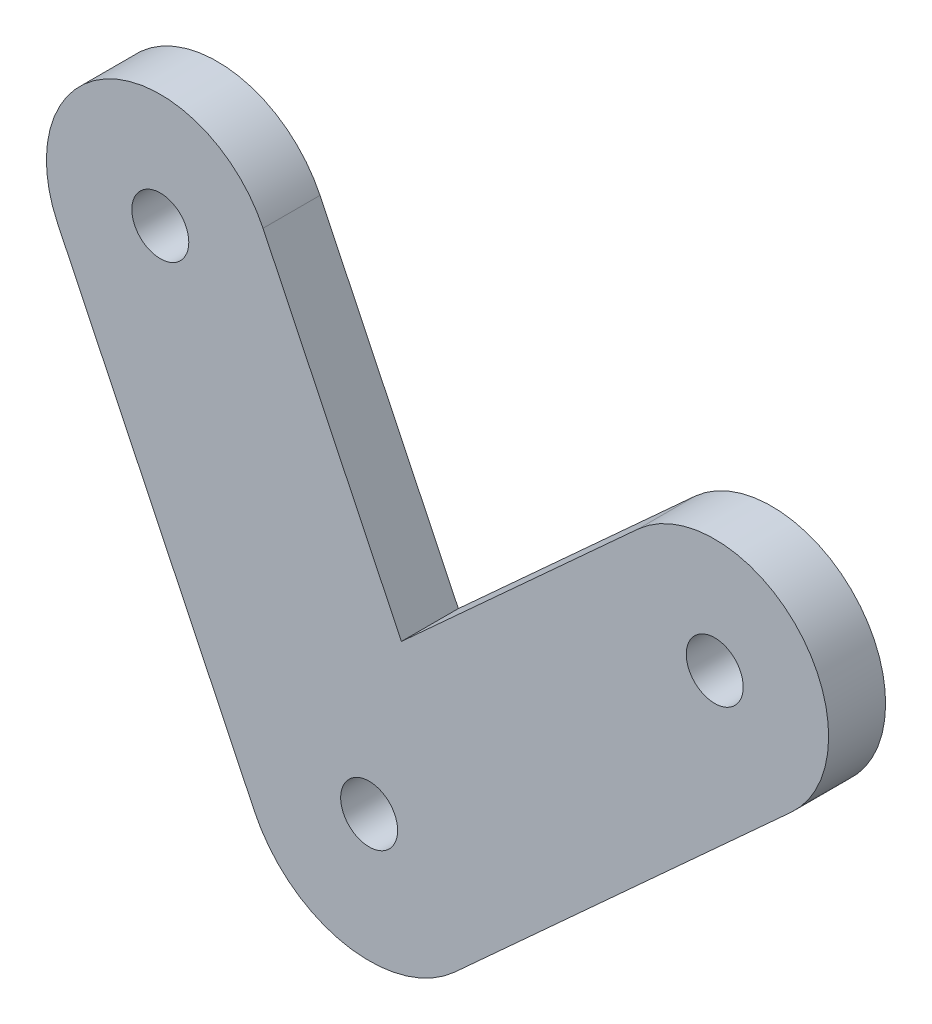
ISO-10303-21;
HEADER;
FILE_DESCRIPTION(('STEP AP214'),'2;1');
FILE_NAME('part.step','',(''),(''),'','','');
FILE_SCHEMA(('AUTOMOTIVE_DESIGN { 1 0 10303 214 1 1 1 1 }'));
ENDSEC;
DATA;
#1=APPLICATION_CONTEXT('core data for automotive mechanical design processes');
#2=APPLICATION_PROTOCOL_DEFINITION('international standard','automotive_design',2000,#1);
#3=PRODUCT_CONTEXT('',#1,'mechanical');
#4=PRODUCT('Part','Part','',(#3));
#5=PRODUCT_RELATED_PRODUCT_CATEGORY('part','',(#4));
#6=PRODUCT_DEFINITION_FORMATION('','',#4);
#7=PRODUCT_DEFINITION_CONTEXT('part definition',#1,'design');
#8=PRODUCT_DEFINITION('design','',#6,#7);
#9=PRODUCT_DEFINITION_SHAPE('','',#8);
#10=(LENGTH_UNIT() NAMED_UNIT(*) SI_UNIT(.MILLI.,.METRE.));
#11=(NAMED_UNIT(*) PLANE_ANGLE_UNIT() SI_UNIT($,.RADIAN.));
#12=(NAMED_UNIT(*) SI_UNIT($,.STERADIAN.) SOLID_ANGLE_UNIT());
#13=UNCERTAINTY_MEASURE_WITH_UNIT(LENGTH_MEASURE(1.E-05),#10,'distance_accuracy_value','');
#14=(GEOMETRIC_REPRESENTATION_CONTEXT(3) GLOBAL_UNCERTAINTY_ASSIGNED_CONTEXT((#13)) GLOBAL_UNIT_ASSIGNED_CONTEXT((#10,
#11,#12)) REPRESENTATION_CONTEXT('',''));
#15=CARTESIAN_POINT('',(0.,0.,0.));
#16=DIRECTION('',(0.,0.,1.));
#17=DIRECTION('',(1.,0.,0.));
#18=AXIS2_PLACEMENT_3D('',#15,#16,#17);
#19=CARTESIAN_POINT('',(24.2357081569548,10.7533268716358,3.175));
#20=DIRECTION('',(0.,0.,1.));
#21=DIRECTION('',(1.,0.,0.));
#22=AXIS2_PLACEMENT_3D('',#19,#20,#21);
#23=PLANE('',#22);
#24=CARTESIAN_POINT('',(24.2357081569548,10.7533268716358,3.175));
#25=DIRECTION('',(0.,0.,1.));
#26=DIRECTION('',(1.,0.,0.));
#27=AXIS2_PLACEMENT_3D('',#24,#25,#26);
#28=CIRCLE('',#27,1.5875);
#29=CARTESIAN_POINT('',(25.8232081569548,10.7533268716358,3.175));
#30=VERTEX_POINT('',#29);
#31=EDGE_CURVE('E164',#30,#30,#28,.T.);
#32=ORIENTED_EDGE('',*,*,#31,.F.);
#33=EDGE_LOOP('',(#32));
#34=FACE_BOUND('',#33,.T.);
#35=CARTESIAN_POINT('',(24.2357081569548,10.7533268716358,3.175));
#36=DIRECTION('',(0.,0.,1.));
#37=DIRECTION('',(1.,0.,0.));
#38=AXIS2_PLACEMENT_3D('',#35,#36,#37);
#39=CIRCLE('',#38,6.35);
#40=CARTESIAN_POINT('',(28.5130909433201,6.060087425485,3.175));
#41=VERTEX_POINT('',#40);
#42=CARTESIAN_POINT('',(19.9583253705896,15.4465663177866,3.175));
#43=VERTEX_POINT('',#42);
#44=EDGE_CURVE('E137',#41,#43,#39,.T.);
#45=ORIENTED_EDGE('',*,*,#44,.T.);
#46=DIRECTION('',(-0.739092826165481,-0.673603588403982,0.));
#47=VECTOR('',#46,1.);
#48=CARTESIAN_POINT('',(6.77121745735409,3.42793632091378,3.175));
#49=LINE('',#48,#47);
#50=CARTESIAN_POINT('',(6.77121745735409,3.42793632091378,3.175));
#51=VERTEX_POINT('',#50);
#52=EDGE_CURVE('E90',#43,#51,#49,.T.);
#53=ORIENTED_EDGE('',*,*,#52,.T.);
#54=DIRECTION('',(-0.432277682531421,0.901740542054788,0.));
#55=VECTOR('',#54,1.);
#56=CARTESIAN_POINT('',(-0.941605947522081,19.5170518106554,3.175));
#57=LINE('',#56,#55);
#58=CARTESIAN_POINT('',(-0.941605947522079,19.5170518106554,3.175));
#59=VERTEX_POINT('',#58);
#60=EDGE_CURVE('E149',#51,#59,#57,.T.);
#61=ORIENTED_EDGE('',*,*,#60,.T.);
#62=CARTESIAN_POINT('',(-6.66765838956999,16.7720885265809,3.175));
#63=DIRECTION('',(0.,0.,1.));
#64=DIRECTION('',(1.,0.,0.));
#65=AXIS2_PLACEMENT_3D('',#62,#63,#64);
#66=CIRCLE('',#65,6.35);
#67=CARTESIAN_POINT('',(-12.3937108316179,14.0271252425063,3.175));
#68=VERTEX_POINT('',#67);
#69=EDGE_CURVE('E106',#59,#68,#66,.T.);
#70=ORIENTED_EDGE('',*,*,#69,.T.);
#71=DIRECTION('',(0.432277682531421,-0.901740542054789,0.));
#72=VECTOR('',#71,1.);
#73=CARTESIAN_POINT('',(-1.41849745212743,-8.86740589320487,3.175));
#74=LINE('',#73,#72);
#75=CARTESIAN_POINT('',(-1.41849745212743,-8.86740589320487,3.175));
#76=VERTEX_POINT('',#75);
#77=EDGE_CURVE('E100',#68,#76,#74,.T.);
#78=ORIENTED_EDGE('',*,*,#77,.T.);
#79=CARTESIAN_POINT('',(4.97333962572611,-5.80327780949156,3.175));
#80=DIRECTION('',(0.,0.,1.));
#81=DIRECTION('',(1.,0.,0.));
#82=AXIS2_PLACEMENT_3D('',#79,#80,#81);
#83=CIRCLE('',#82,7.08833281831658);
#84=CARTESIAN_POINT('',(9.74806604794587,-11.0422137449827,3.175));
#85=VERTEX_POINT('',#84);
#86=EDGE_CURVE('E104',#76,#85,#83,.T.);
#87=ORIENTED_EDGE('',*,*,#86,.T.);
#88=DIRECTION('',(0.739092826165481,0.673603588403983,0.));
#89=VECTOR('',#88,1.);
#90=CARTESIAN_POINT('',(28.5130909433201,6.060087425485,3.175));
#91=LINE('',#90,#89);
#92=EDGE_CURVE('E50',#85,#41,#91,.T.);
#93=ORIENTED_EDGE('',*,*,#92,.T.);
#94=EDGE_LOOP('',(#45,#53,#61,#70,#78,#87,#93));
#95=FACE_BOUND('',#94,.T.);
#96=CARTESIAN_POINT('',(-6.66765838956999,16.7720885265809,3.175));
#97=DIRECTION('',(0.,0.,1.));
#98=DIRECTION('',(1.,0.,0.));
#99=AXIS2_PLACEMENT_3D('',#96,#97,#98);
#100=CIRCLE('',#99,1.5875);
#101=CARTESIAN_POINT('',(-5.08015838956999,16.7720885265809,3.175));
#102=VERTEX_POINT('',#101);
#103=EDGE_CURVE('E128',#102,#102,#100,.T.);
#104=ORIENTED_EDGE('',*,*,#103,.F.);
#105=EDGE_LOOP('',(#104));
#106=FACE_BOUND('',#105,.T.);
#107=CARTESIAN_POINT('',(4.97333962572611,-5.80327780949156,3.175));
#108=DIRECTION('',(0.,0.,1.));
#109=DIRECTION('',(1.,0.,0.));
#110=AXIS2_PLACEMENT_3D('',#107,#108,#109);
#111=CIRCLE('',#110,1.5875);
#112=CARTESIAN_POINT('',(6.56083962572611,-5.80327780949156,3.175));
#113=VERTEX_POINT('',#112);
#114=EDGE_CURVE('E170',#113,#113,#111,.T.);
#115=ORIENTED_EDGE('',*,*,#114,.F.);
#116=EDGE_LOOP('',(#115));
#117=FACE_BOUND('',#116,.T.);
#118=ADVANCED_FACE('F33',(#34,#95,#106,#117),#23,.T.);
#119=CARTESIAN_POINT('',(24.2357081569548,10.7533268716358,0.));
#120=DIRECTION('',(0.,0.,1.));
#121=DIRECTION('',(1.,0.,0.));
#122=AXIS2_PLACEMENT_3D('',#119,#120,#121);
#123=PLANE('',#122);
#124=CARTESIAN_POINT('',(24.2357081569548,10.7533268716358,0.));
#125=DIRECTION('',(0.,0.,1.));
#126=DIRECTION('',(1.,0.,0.));
#127=AXIS2_PLACEMENT_3D('',#124,#125,#126);
#128=CIRCLE('',#127,6.35);
#129=CARTESIAN_POINT('',(28.5130909433201,6.060087425485,0.));
#130=VERTEX_POINT('',#129);
#131=CARTESIAN_POINT('',(19.9583253705896,15.4465663177866,0.));
#132=VERTEX_POINT('',#131);
#133=EDGE_CURVE('E124',#130,#132,#128,.T.);
#134=ORIENTED_EDGE('',*,*,#133,.F.);
#135=DIRECTION('',(0.739092826165481,0.673603588403983,0.));
#136=VECTOR('',#135,1.);
#137=CARTESIAN_POINT('',(28.5130909433201,6.060087425485,0.));
#138=LINE('',#137,#136);
#139=CARTESIAN_POINT('',(9.74806604794587,-11.0422137449827,0.));
#140=VERTEX_POINT('',#139);
#141=EDGE_CURVE('E82',#140,#130,#138,.T.);
#142=ORIENTED_EDGE('',*,*,#141,.F.);
#143=CARTESIAN_POINT('',(4.97333962572611,-5.80327780949156,0.));
#144=DIRECTION('',(0.,0.,1.));
#145=DIRECTION('',(1.,0.,0.));
#146=AXIS2_PLACEMENT_3D('',#143,#144,#145);
#147=CIRCLE('',#146,7.08833281831658);
#148=CARTESIAN_POINT('',(-1.41849745212743,-8.86740589320487,0.));
#149=VERTEX_POINT('',#148);
#150=EDGE_CURVE('E76',#149,#140,#147,.T.);
#151=ORIENTED_EDGE('',*,*,#150,.F.);
#152=DIRECTION('',(0.432277682531421,-0.901740542054789,0.));
#153=VECTOR('',#152,1.);
#154=CARTESIAN_POINT('',(-1.41849745212743,-8.86740589320487,0.));
#155=LINE('',#154,#153);
#156=CARTESIAN_POINT('',(-12.3937108316179,14.0271252425063,0.));
#157=VERTEX_POINT('',#156);
#158=EDGE_CURVE('E114',#157,#149,#155,.T.);
#159=ORIENTED_EDGE('',*,*,#158,.F.);
#160=CARTESIAN_POINT('',(-6.66765838956999,16.7720885265809,0.));
#161=DIRECTION('',(0.,0.,1.));
#162=DIRECTION('',(1.,0.,0.));
#163=AXIS2_PLACEMENT_3D('',#160,#161,#162);
#164=CIRCLE('',#163,6.35);
#165=CARTESIAN_POINT('',(-0.941605947522079,19.5170518106554,0.));
#166=VERTEX_POINT('',#165);
#167=EDGE_CURVE('E132',#166,#157,#164,.T.);
#168=ORIENTED_EDGE('',*,*,#167,.F.);
#169=DIRECTION('',(-0.432277682531421,0.901740542054788,0.));
#170=VECTOR('',#169,1.);
#171=CARTESIAN_POINT('',(-0.941605947522081,19.5170518106554,0.));
#172=LINE('',#171,#170);
#173=CARTESIAN_POINT('',(6.77121745735409,3.42793632091378,0.));
#174=VERTEX_POINT('',#173);
#175=EDGE_CURVE('E130',#174,#166,#172,.T.);
#176=ORIENTED_EDGE('',*,*,#175,.F.);
#177=DIRECTION('',(-0.739092826165481,-0.673603588403982,0.));
#178=VECTOR('',#177,1.);
#179=CARTESIAN_POINT('',(6.77121745735409,3.42793632091378,0.));
#180=LINE('',#179,#178);
#181=EDGE_CURVE('E127',#132,#174,#180,.T.);
#182=ORIENTED_EDGE('',*,*,#181,.F.);
#183=EDGE_LOOP('',(#134,#142,#151,#159,#168,#176,#182));
#184=FACE_BOUND('',#183,.T.);
#185=CARTESIAN_POINT('',(-6.66765838956999,16.7720885265809,0.));
#186=DIRECTION('',(0.,0.,1.));
#187=DIRECTION('',(1.,0.,0.));
#188=AXIS2_PLACEMENT_3D('',#185,#186,#187);
#189=CIRCLE('',#188,1.5875);
#190=CARTESIAN_POINT('',(-5.08015838956999,16.7720885265809,0.));
#191=VERTEX_POINT('',#190);
#192=EDGE_CURVE('E161',#191,#191,#189,.T.);
#193=ORIENTED_EDGE('',*,*,#192,.T.);
#194=EDGE_LOOP('',(#193));
#195=FACE_BOUND('',#194,.T.);
#196=CARTESIAN_POINT('',(24.2357081569548,10.7533268716358,0.));
#197=DIRECTION('',(0.,0.,1.));
#198=DIRECTION('',(1.,0.,0.));
#199=AXIS2_PLACEMENT_3D('',#196,#197,#198);
#200=CIRCLE('',#199,1.5875);
#201=CARTESIAN_POINT('',(25.8232081569548,10.7533268716358,0.));
#202=VERTEX_POINT('',#201);
#203=EDGE_CURVE('E167',#202,#202,#200,.T.);
#204=ORIENTED_EDGE('',*,*,#203,.T.);
#205=EDGE_LOOP('',(#204));
#206=FACE_BOUND('',#205,.T.);
#207=CARTESIAN_POINT('',(4.97333962572611,-5.80327780949156,0.));
#208=DIRECTION('',(0.,0.,1.));
#209=DIRECTION('',(1.,0.,0.));
#210=AXIS2_PLACEMENT_3D('',#207,#208,#209);
#211=CIRCLE('',#210,1.5875);
#212=CARTESIAN_POINT('',(6.56083962572611,-5.80327780949156,0.));
#213=VERTEX_POINT('',#212);
#214=EDGE_CURVE('E173',#213,#213,#211,.T.);
#215=ORIENTED_EDGE('',*,*,#214,.T.);
#216=EDGE_LOOP('',(#215));
#217=FACE_BOUND('',#216,.T.);
#218=ADVANCED_FACE('F153',(#184,#195,#206,#217),#123,.F.);
#219=CARTESIAN_POINT('',(24.2357081569548,10.7533268716358,3.175));
#220=DIRECTION('',(0.,0.,-1.));
#221=DIRECTION('',(-1.,0.,0.));
#222=AXIS2_PLACEMENT_3D('',#219,#220,#221);
#223=CYLINDRICAL_SURFACE('',#222,6.35);
#224=ORIENTED_EDGE('',*,*,#133,.T.);
#225=DIRECTION('',(0.,0.,-1.));
#226=VECTOR('',#225,1.);
#227=CARTESIAN_POINT('',(19.9583253705896,15.4465663177866,3.175));
#228=LINE('',#227,#226);
#229=EDGE_CURVE('E11',#43,#132,#228,.T.);
#230=ORIENTED_EDGE('',*,*,#229,.F.);
#231=ORIENTED_EDGE('',*,*,#44,.F.);
#232=DIRECTION('',(0.,0.,-1.));
#233=VECTOR('',#232,1.);
#234=CARTESIAN_POINT('',(28.5130909433201,6.060087425485,3.175));
#235=LINE('',#234,#233);
#236=EDGE_CURVE('E120',#41,#130,#235,.T.);
#237=ORIENTED_EDGE('',*,*,#236,.T.);
#238=EDGE_LOOP('',(#224,#230,#231,#237));
#239=FACE_BOUND('',#238,.T.);
#240=ADVANCED_FACE('F35',(#239),#223,.T.);
#241=CARTESIAN_POINT('',(6.77121745735409,3.42793632091378,3.175));
#242=DIRECTION('',(0.673603588403982,-0.739092826165481,0.));
#243=DIRECTION('',(0.739092826165481,0.673603588403982,0.));
#244=AXIS2_PLACEMENT_3D('',#241,#242,#243);
#245=PLANE('',#244);
#246=ORIENTED_EDGE('',*,*,#181,.T.);
#247=DIRECTION('',(0.,0.,-1.));
#248=VECTOR('',#247,1.);
#249=CARTESIAN_POINT('',(6.77121745735409,3.42793632091378,3.175));
#250=LINE('',#249,#248);
#251=EDGE_CURVE('E42',#51,#174,#250,.T.);
#252=ORIENTED_EDGE('',*,*,#251,.F.);
#253=ORIENTED_EDGE('',*,*,#52,.F.);
#254=ORIENTED_EDGE('',*,*,#229,.T.);
#255=EDGE_LOOP('',(#246,#252,#253,#254));
#256=FACE_BOUND('',#255,.T.);
#257=ADVANCED_FACE('F204',(#256),#245,.F.);
#258=CARTESIAN_POINT('',(-0.941605947522081,19.5170518106554,3.175));
#259=DIRECTION('',(-0.901740542054788,-0.432277682531421,0.));
#260=DIRECTION('',(0.432277682531421,-0.901740542054789,0.));
#261=AXIS2_PLACEMENT_3D('',#258,#259,#260);
#262=PLANE('',#261);
#263=ORIENTED_EDGE('',*,*,#175,.T.);
#264=DIRECTION('',(0.,0.,-1.));
#265=VECTOR('',#264,1.);
#266=CARTESIAN_POINT('',(-0.941605947522079,19.5170518106554,3.175));
#267=LINE('',#266,#265);
#268=EDGE_CURVE('E141',#59,#166,#267,.T.);
#269=ORIENTED_EDGE('',*,*,#268,.F.);
#270=ORIENTED_EDGE('',*,*,#60,.F.);
#271=ORIENTED_EDGE('',*,*,#251,.T.);
#272=EDGE_LOOP('',(#263,#269,#270,#271));
#273=FACE_BOUND('',#272,.T.);
#274=ADVANCED_FACE('F147',(#273),#262,.F.);
#275=CARTESIAN_POINT('',(-6.66765838956999,16.7720885265809,3.175));
#276=DIRECTION('',(0.,0.,-1.));
#277=DIRECTION('',(-1.,0.,0.));
#278=AXIS2_PLACEMENT_3D('',#275,#276,#277);
#279=CYLINDRICAL_SURFACE('',#278,6.35);
#280=ORIENTED_EDGE('',*,*,#167,.T.);
#281=DIRECTION('',(0.,0.,-1.));
#282=VECTOR('',#281,1.);
#283=CARTESIAN_POINT('',(-12.3937108316179,14.0271252425063,3.175));
#284=LINE('',#283,#282);
#285=EDGE_CURVE('E115',#68,#157,#284,.T.);
#286=ORIENTED_EDGE('',*,*,#285,.F.);
#287=ORIENTED_EDGE('',*,*,#69,.F.);
#288=ORIENTED_EDGE('',*,*,#268,.T.);
#289=EDGE_LOOP('',(#280,#286,#287,#288));
#290=FACE_BOUND('',#289,.T.);
#291=ADVANCED_FACE('F156',(#290),#279,.T.);
#292=CARTESIAN_POINT('',(-1.41849745212743,-8.86740589320487,3.175));
#293=DIRECTION('',(0.901740542054789,0.432277682531421,0.));
#294=DIRECTION('',(-0.432277682531421,0.901740542054789,0.));
#295=AXIS2_PLACEMENT_3D('',#292,#293,#294);
#296=PLANE('',#295);
#297=ORIENTED_EDGE('',*,*,#158,.T.);
#298=DIRECTION('',(0.,0.,-1.));
#299=VECTOR('',#298,1.);
#300=CARTESIAN_POINT('',(-1.41849745212743,-8.86740589320487,3.175));
#301=LINE('',#300,#299);
#302=EDGE_CURVE('E111',#76,#149,#301,.T.);
#303=ORIENTED_EDGE('',*,*,#302,.F.);
#304=ORIENTED_EDGE('',*,*,#77,.F.);
#305=ORIENTED_EDGE('',*,*,#285,.T.);
#306=EDGE_LOOP('',(#297,#303,#304,#305));
#307=FACE_BOUND('',#306,.T.);
#308=ADVANCED_FACE('F112',(#307),#296,.F.);
#309=CARTESIAN_POINT('',(4.97333962572611,-5.80327780949156,3.175));
#310=DIRECTION('',(0.,0.,-1.));
#311=DIRECTION('',(-1.,0.,0.));
#312=AXIS2_PLACEMENT_3D('',#309,#310,#311);
#313=CYLINDRICAL_SURFACE('',#312,7.08833281831658);
#314=ORIENTED_EDGE('',*,*,#150,.T.);
#315=DIRECTION('',(0.,0.,-1.));
#316=VECTOR('',#315,1.);
#317=CARTESIAN_POINT('',(9.74806604794587,-11.0422137449827,3.175));
#318=LINE('',#317,#316);
#319=EDGE_CURVE('E116',#85,#140,#318,.T.);
#320=ORIENTED_EDGE('',*,*,#319,.F.);
#321=ORIENTED_EDGE('',*,*,#86,.F.);
#322=ORIENTED_EDGE('',*,*,#302,.T.);
#323=EDGE_LOOP('',(#314,#320,#321,#322));
#324=FACE_BOUND('',#323,.T.);
#325=ADVANCED_FACE('F118',(#324),#313,.T.);
#326=CARTESIAN_POINT('',(28.5130909433201,6.060087425485,3.175));
#327=DIRECTION('',(-0.673603588403983,0.739092826165481,0.));
#328=DIRECTION('',(-0.739092826165481,-0.673603588403983,0.));
#329=AXIS2_PLACEMENT_3D('',#326,#327,#328);
#330=PLANE('',#329);
#331=ORIENTED_EDGE('',*,*,#141,.T.);
#332=ORIENTED_EDGE('',*,*,#236,.F.);
#333=ORIENTED_EDGE('',*,*,#92,.F.);
#334=ORIENTED_EDGE('',*,*,#319,.T.);
#335=EDGE_LOOP('',(#331,#332,#333,#334));
#336=FACE_BOUND('',#335,.T.);
#337=ADVANCED_FACE('F194',(#336),#330,.F.);
#338=CARTESIAN_POINT('',(-6.66765838956999,16.7720885265809,3.175));
#339=DIRECTION('',(0.,0.,-1.));
#340=DIRECTION('',(-1.,0.,0.));
#341=AXIS2_PLACEMENT_3D('',#338,#339,#340);
#342=CYLINDRICAL_SURFACE('',#341,1.5875);
#343=ORIENTED_EDGE('',*,*,#103,.T.);
#344=EDGE_LOOP('',(#343));
#345=FACE_BOUND('',#344,.T.);
#346=ORIENTED_EDGE('',*,*,#192,.F.);
#347=EDGE_LOOP('',(#346));
#348=FACE_BOUND('',#347,.T.);
#349=ADVANCED_FACE('F191',(#345,#348),#342,.F.);
#350=CARTESIAN_POINT('',(24.2357081569548,10.7533268716358,3.175));
#351=DIRECTION('',(0.,0.,-1.));
#352=DIRECTION('',(-1.,0.,0.));
#353=AXIS2_PLACEMENT_3D('',#350,#351,#352);
#354=CYLINDRICAL_SURFACE('',#353,1.5875);
#355=ORIENTED_EDGE('',*,*,#31,.T.);
#356=EDGE_LOOP('',(#355));
#357=FACE_BOUND('',#356,.T.);
#358=ORIENTED_EDGE('',*,*,#203,.F.);
#359=EDGE_LOOP('',(#358));
#360=FACE_BOUND('',#359,.T.);
#361=ADVANCED_FACE('F263',(#357,#360),#354,.F.);
#362=CARTESIAN_POINT('',(4.97333962572611,-5.80327780949156,3.175));
#363=DIRECTION('',(0.,0.,-1.));
#364=DIRECTION('',(-1.,0.,0.));
#365=AXIS2_PLACEMENT_3D('',#362,#363,#364);
#366=CYLINDRICAL_SURFACE('',#365,1.5875);
#367=ORIENTED_EDGE('',*,*,#114,.T.);
#368=EDGE_LOOP('',(#367));
#369=FACE_BOUND('',#368,.T.);
#370=ORIENTED_EDGE('',*,*,#214,.F.);
#371=EDGE_LOOP('',(#370));
#372=FACE_BOUND('',#371,.T.);
#373=ADVANCED_FACE('F179',(#369,#372),#366,.F.);
#374=CLOSED_SHELL('',(#118,#218,#240,#257,#274,#291,#308,#325,#337,#349,#361,#373));
#375=MANIFOLD_SOLID_BREP('B2',#374);
#376=ADVANCED_BREP_SHAPE_REPRESENTATION('',(#18,#375),#14);
#377=SHAPE_DEFINITION_REPRESENTATION(#9,#376);
ENDSEC;
END-ISO-10303-21;
